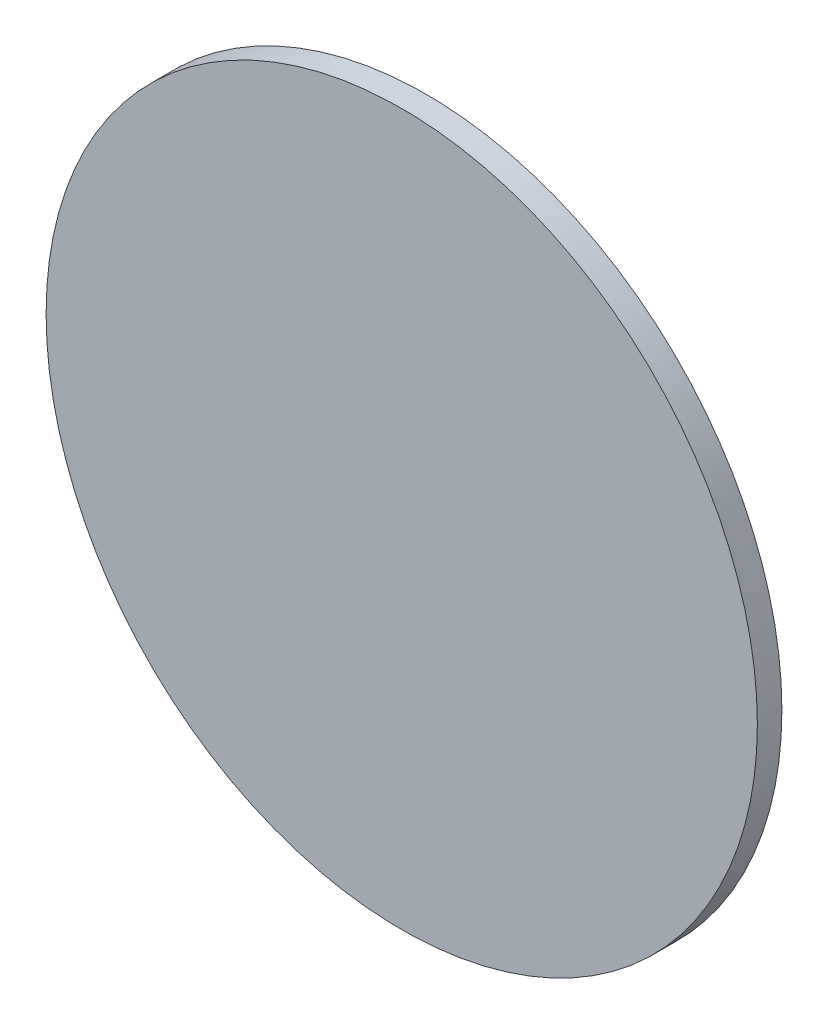
ISO-10303-21;
HEADER;
FILE_DESCRIPTION(('STEP AP214'),'2;1');
FILE_NAME('part.step','',(''),(''),'','','');
FILE_SCHEMA(('AUTOMOTIVE_DESIGN { 1 0 10303 214 1 1 1 1 }'));
ENDSEC;
DATA;
#1=APPLICATION_CONTEXT('core data for automotive mechanical design processes');
#2=APPLICATION_PROTOCOL_DEFINITION('international standard','automotive_design',2000,#1);
#3=PRODUCT_CONTEXT('',#1,'mechanical');
#4=PRODUCT('Part','Part','',(#3));
#5=PRODUCT_RELATED_PRODUCT_CATEGORY('part','',(#4));
#6=PRODUCT_DEFINITION_FORMATION('','',#4);
#7=PRODUCT_DEFINITION_CONTEXT('part definition',#1,'design');
#8=PRODUCT_DEFINITION('design','',#6,#7);
#9=PRODUCT_DEFINITION_SHAPE('','',#8);
#10=(LENGTH_UNIT() NAMED_UNIT(*) SI_UNIT(.MILLI.,.METRE.));
#11=(NAMED_UNIT(*) PLANE_ANGLE_UNIT() SI_UNIT($,.RADIAN.));
#12=(NAMED_UNIT(*) SI_UNIT($,.STERADIAN.) SOLID_ANGLE_UNIT());
#13=UNCERTAINTY_MEASURE_WITH_UNIT(LENGTH_MEASURE(1.E-05),#10,'distance_accuracy_value','');
#14=(GEOMETRIC_REPRESENTATION_CONTEXT(3) GLOBAL_UNCERTAINTY_ASSIGNED_CONTEXT((#13)) GLOBAL_UNIT_ASSIGNED_CONTEXT((#10,
#11,#12)) REPRESENTATION_CONTEXT('',''));
#15=CARTESIAN_POINT('',(0.,0.,0.));
#16=DIRECTION('',(0.,0.,1.));
#17=DIRECTION('',(1.,0.,0.));
#18=AXIS2_PLACEMENT_3D('',#15,#16,#17);
#19=CARTESIAN_POINT('',(0.,0.,1.));
#20=DIRECTION('',(0.,0.,-1.));
#21=DIRECTION('',(-1.,0.,0.));
#22=AXIS2_PLACEMENT_3D('',#19,#20,#21);
#23=CYLINDRICAL_SURFACE('',#22,14.5);
#24=CARTESIAN_POINT('',(0.,0.,1.));
#25=DIRECTION('',(0.,0.,1.));
#26=DIRECTION('',(1.,0.,0.));
#27=AXIS2_PLACEMENT_3D('',#24,#25,#26);
#28=CIRCLE('',#27,14.5);
#29=CARTESIAN_POINT('',(14.5,0.,1.));
#30=VERTEX_POINT('',#29);
#31=EDGE_CURVE('E10',#30,#30,#28,.T.);
#32=ORIENTED_EDGE('',*,*,#31,.F.);
#33=EDGE_LOOP('',(#32));
#34=FACE_BOUND('',#33,.T.);
#35=CARTESIAN_POINT('',(0.,0.,0.));
#36=DIRECTION('',(0.,0.,1.));
#37=DIRECTION('',(1.,0.,0.));
#38=AXIS2_PLACEMENT_3D('',#35,#36,#37);
#39=CIRCLE('',#38,14.5);
#40=CARTESIAN_POINT('',(14.5,0.,0.));
#41=VERTEX_POINT('',#40);
#42=EDGE_CURVE('E35',#41,#41,#39,.T.);
#43=ORIENTED_EDGE('',*,*,#42,.T.);
#44=EDGE_LOOP('',(#43));
#45=FACE_BOUND('',#44,.T.);
#46=ADVANCED_FACE('F32',(#34,#45),#23,.T.);
#47=CARTESIAN_POINT('',(0.,0.,1.));
#48=DIRECTION('',(0.,0.,1.));
#49=DIRECTION('',(1.,0.,0.));
#50=AXIS2_PLACEMENT_3D('',#47,#48,#49);
#51=PLANE('',#50);
#52=ORIENTED_EDGE('',*,*,#31,.T.);
#53=EDGE_LOOP('',(#52));
#54=FACE_BOUND('',#53,.T.);
#55=ADVANCED_FACE('F47',(#54),#51,.T.);
#56=CARTESIAN_POINT('',(0.,0.,0.));
#57=DIRECTION('',(0.,0.,1.));
#58=DIRECTION('',(1.,0.,0.));
#59=AXIS2_PLACEMENT_3D('',#56,#57,#58);
#60=PLANE('',#59);
#61=ORIENTED_EDGE('',*,*,#42,.F.);
#62=EDGE_LOOP('',(#61));
#63=FACE_BOUND('',#62,.T.);
#64=ADVANCED_FACE('F45',(#63),#60,.F.);
#65=CLOSED_SHELL('',(#46,#55,#64));
#66=MANIFOLD_SOLID_BREP('B2',#65);
#67=ADVANCED_BREP_SHAPE_REPRESENTATION('',(#18,#66),#14);
#68=SHAPE_DEFINITION_REPRESENTATION(#9,#67);
ENDSEC;
END-ISO-10303-21;
